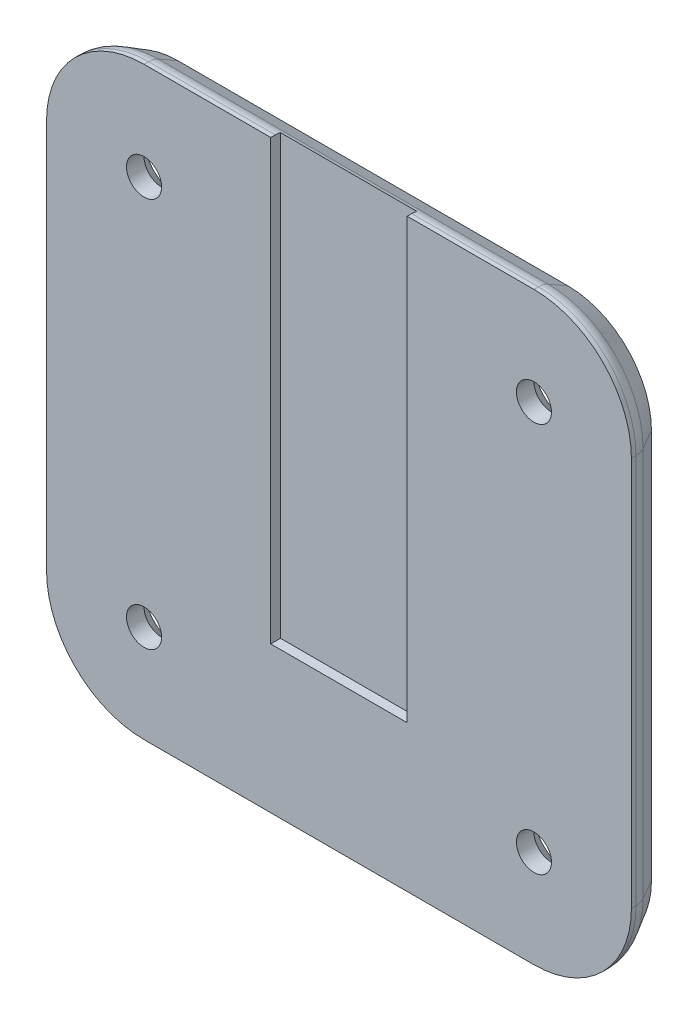
ISO-10303-21;
HEADER;
FILE_DESCRIPTION(('STEP AP214'),'2;1');
FILE_NAME('part.step','',(''),(''),'','','');
FILE_SCHEMA(('AUTOMOTIVE_DESIGN { 1 0 10303 214 1 1 1 1 }'));
ENDSEC;
DATA;
#1=APPLICATION_CONTEXT('core data for automotive mechanical design processes');
#2=APPLICATION_PROTOCOL_DEFINITION('international standard','automotive_design',2000,#1);
#3=PRODUCT_CONTEXT('',#1,'mechanical');
#4=PRODUCT('Part','Part','',(#3));
#5=PRODUCT_RELATED_PRODUCT_CATEGORY('part','',(#4));
#6=PRODUCT_DEFINITION_FORMATION('','',#4);
#7=PRODUCT_DEFINITION_CONTEXT('part definition',#1,'design');
#8=PRODUCT_DEFINITION('design','',#6,#7);
#9=PRODUCT_DEFINITION_SHAPE('','',#8);
#10=(LENGTH_UNIT() NAMED_UNIT(*) SI_UNIT(.MILLI.,.METRE.));
#11=(NAMED_UNIT(*) PLANE_ANGLE_UNIT() SI_UNIT($,.RADIAN.));
#12=(NAMED_UNIT(*) SI_UNIT($,.STERADIAN.) SOLID_ANGLE_UNIT());
#13=UNCERTAINTY_MEASURE_WITH_UNIT(LENGTH_MEASURE(1.E-05),#10,'distance_accuracy_value','');
#14=(GEOMETRIC_REPRESENTATION_CONTEXT(3) GLOBAL_UNCERTAINTY_ASSIGNED_CONTEXT((#13)) GLOBAL_UNIT_ASSIGNED_CONTEXT((#10,
#11,#12)) REPRESENTATION_CONTEXT('',''));
#15=CARTESIAN_POINT('',(0.,0.,0.));
#16=DIRECTION('',(0.,0.,1.));
#17=DIRECTION('',(1.,0.,0.));
#18=AXIS2_PLACEMENT_3D('',#15,#16,#17);
#19=CARTESIAN_POINT('',(-20.,20.,3.50000000000014));
#20=DIRECTION('',(0.,0.,1.));
#21=DIRECTION('',(1.,0.,0.));
#22=AXIS2_PLACEMENT_3D('',#19,#20,#21);
#23=PLANE('',#22);
#24=CARTESIAN_POINT('',(20.,20.,3.49999999999986));
#25=DIRECTION('',(0.,0.,-1.));
#26=DIRECTION('',(-1.,0.,0.));
#27=AXIS2_PLACEMENT_3D('',#24,#25,#26);
#28=CIRCLE('',#27,1.8);
#29=CARTESIAN_POINT('',(18.2,20.,3.49999999999987));
#30=VERTEX_POINT('',#29);
#31=EDGE_CURVE('E216',#30,#30,#28,.T.);
#32=ORIENTED_EDGE('',*,*,#31,.T.);
#33=EDGE_LOOP('',(#32));
#34=FACE_BOUND('',#33,.T.);
#35=CARTESIAN_POINT('',(-20.,20.,3.50000000000014));
#36=DIRECTION('',(0.,0.,-1.));
#37=DIRECTION('',(-1.,0.,0.));
#38=AXIS2_PLACEMENT_3D('',#35,#36,#37);
#39=CIRCLE('',#38,1.8);
#40=CARTESIAN_POINT('',(-21.8,20.,3.50000000000015));
#41=VERTEX_POINT('',#40);
#42=EDGE_CURVE('E225',#41,#41,#39,.T.);
#43=ORIENTED_EDGE('',*,*,#42,.T.);
#44=EDGE_LOOP('',(#43));
#45=FACE_BOUND('',#44,.T.);
#46=CARTESIAN_POINT('',(-20.,-20.,3.50000000000014));
#47=DIRECTION('',(0.,0.,-1.));
#48=DIRECTION('',(-1.,0.,0.));
#49=AXIS2_PLACEMENT_3D('',#46,#47,#48);
#50=CIRCLE('',#49,1.8);
#51=CARTESIAN_POINT('',(-21.8,-20.,3.50000000000015));
#52=VERTEX_POINT('',#51);
#53=EDGE_CURVE('E234',#52,#52,#50,.T.);
#54=ORIENTED_EDGE('',*,*,#53,.T.);
#55=EDGE_LOOP('',(#54));
#56=FACE_BOUND('',#55,.T.);
#57=CARTESIAN_POINT('',(20.,-20.,3.49999999999986));
#58=DIRECTION('',(0.,0.,-1.));
#59=DIRECTION('',(-1.,0.,0.));
#60=AXIS2_PLACEMENT_3D('',#57,#58,#59);
#61=CIRCLE('',#60,1.8);
#62=CARTESIAN_POINT('',(18.2,-20.,3.49999999999987));
#63=VERTEX_POINT('',#62);
#64=EDGE_CURVE('E243',#63,#63,#61,.T.);
#65=ORIENTED_EDGE('',*,*,#64,.T.);
#66=EDGE_LOOP('',(#65));
#67=FACE_BOUND('',#66,.T.);
#68=DIRECTION('',(1.,0.,0.));
#69=VECTOR('',#68,1.);
#70=CARTESIAN_POINT('',(20.,30.,3.49999999999986));
#71=LINE('',#70,#69);
#72=CARTESIAN_POINT('',(7.00000000000001,30.,3.49999999999995));
#73=VERTEX_POINT('',#72);
#74=CARTESIAN_POINT('',(20.,30.,3.49999999999986));
#75=VERTEX_POINT('',#74);
#76=EDGE_CURVE('E249',#73,#75,#71,.T.);
#77=ORIENTED_EDGE('',*,*,#76,.F.);
#78=DIRECTION('',(0.,-1.,0.));
#79=VECTOR('',#78,1.);
#80=CARTESIAN_POINT('',(7.00000000000001,20.,3.49999999999995));
#81=LINE('',#80,#79);
#82=CARTESIAN_POINT('',(7.00000000000001,-15.,3.49999999999995));
#83=VERTEX_POINT('',#82);
#84=EDGE_CURVE('E206',#73,#83,#81,.T.);
#85=ORIENTED_EDGE('',*,*,#84,.T.);
#86=DIRECTION('',(-1.,0.,0.));
#87=VECTOR('',#86,1.);
#88=CARTESIAN_POINT('',(-20.,-15.,3.50000000000014));
#89=LINE('',#88,#87);
#90=CARTESIAN_POINT('',(-6.99999999999999,-15.,3.50000000000005));
#91=VERTEX_POINT('',#90);
#92=EDGE_CURVE('E12',#83,#91,#89,.T.);
#93=ORIENTED_EDGE('',*,*,#92,.T.);
#94=DIRECTION('',(0.,1.,0.));
#95=VECTOR('',#94,1.);
#96=CARTESIAN_POINT('',(-6.99999999999999,20.,3.50000000000005));
#97=LINE('',#96,#95);
#98=CARTESIAN_POINT('',(-6.99999999999999,30.,3.50000000000005));
#99=VERTEX_POINT('',#98);
#100=EDGE_CURVE('E192',#91,#99,#97,.T.);
#101=ORIENTED_EDGE('',*,*,#100,.T.);
#102=CARTESIAN_POINT('',(-20.,30.,3.50000000000014));
#103=VERTEX_POINT('',#102);
#104=EDGE_CURVE('E250',#103,#99,#71,.T.);
#105=ORIENTED_EDGE('',*,*,#104,.F.);
#106=CARTESIAN_POINT('',(-20.,20.,3.50000000000014));
#107=DIRECTION('',(0.,0.,-1.));
#108=DIRECTION('',(1.,0.,0.));
#109=AXIS2_PLACEMENT_3D('',#106,#107,#108);
#110=CIRCLE('',#109,10.);
#111=CARTESIAN_POINT('',(-30.,20.,3.50000000000021));
#112=VERTEX_POINT('',#111);
#113=EDGE_CURVE('E246',#112,#103,#110,.T.);
#114=ORIENTED_EDGE('',*,*,#113,.F.);
#115=DIRECTION('',(0.,1.,0.));
#116=VECTOR('',#115,1.);
#117=CARTESIAN_POINT('',(-30.,20.,3.50000000000021));
#118=LINE('',#117,#116);
#119=CARTESIAN_POINT('',(-30.,-20.,3.50000000000021));
#120=VERTEX_POINT('',#119);
#121=EDGE_CURVE('E268',#120,#112,#118,.T.);
#122=ORIENTED_EDGE('',*,*,#121,.F.);
#123=CARTESIAN_POINT('',(-20.,-20.,3.50000000000014));
#124=DIRECTION('',(0.,0.,-1.));
#125=DIRECTION('',(-1.,0.,0.));
#126=AXIS2_PLACEMENT_3D('',#123,#124,#125);
#127=CIRCLE('',#126,10.);
#128=CARTESIAN_POINT('',(-20.,-30.,3.50000000000014));
#129=VERTEX_POINT('',#128);
#130=EDGE_CURVE('E265',#129,#120,#127,.T.);
#131=ORIENTED_EDGE('',*,*,#130,.F.);
#132=DIRECTION('',(-1.,0.,0.));
#133=VECTOR('',#132,1.);
#134=CARTESIAN_POINT('',(20.,-30.,3.49999999999986));
#135=LINE('',#134,#133);
#136=CARTESIAN_POINT('',(20.,-30.,3.49999999999986));
#137=VERTEX_POINT('',#136);
#138=EDGE_CURVE('E262',#137,#129,#135,.T.);
#139=ORIENTED_EDGE('',*,*,#138,.F.);
#140=CARTESIAN_POINT('',(20.,-20.,3.49999999999986));
#141=DIRECTION('',(0.,0.,-1.));
#142=DIRECTION('',(-1.,0.,0.));
#143=AXIS2_PLACEMENT_3D('',#140,#141,#142);
#144=CIRCLE('',#143,10.);
#145=CARTESIAN_POINT('',(30.,-20.,3.49999999999979));
#146=VERTEX_POINT('',#145);
#147=EDGE_CURVE('E259',#146,#137,#144,.T.);
#148=ORIENTED_EDGE('',*,*,#147,.F.);
#149=DIRECTION('',(0.,-1.,0.));
#150=VECTOR('',#149,1.);
#151=CARTESIAN_POINT('',(30.,20.,3.49999999999979));
#152=LINE('',#151,#150);
#153=CARTESIAN_POINT('',(30.,20.,3.49999999999979));
#154=VERTEX_POINT('',#153);
#155=EDGE_CURVE('E256',#154,#146,#152,.T.);
#156=ORIENTED_EDGE('',*,*,#155,.F.);
#157=CARTESIAN_POINT('',(20.,20.,3.49999999999986));
#158=DIRECTION('',(0.,0.,-1.));
#159=DIRECTION('',(-1.,0.,0.));
#160=AXIS2_PLACEMENT_3D('',#157,#158,#159);
#161=CIRCLE('',#160,10.);
#162=EDGE_CURVE('E253',#75,#154,#161,.T.);
#163=ORIENTED_EDGE('',*,*,#162,.F.);
#164=EDGE_LOOP('',(#77,#85,#93,#101,#105,#114,#122,#131,#139,#148,#156,#163));
#165=FACE_BOUND('',#164,.T.);
#166=ADVANCED_FACE('F33',(#34,#45,#56,#67,#165),#23,.T.);
#167=CARTESIAN_POINT('',(20.,30.,-1.39645239816133E-13));
#168=DIRECTION('',(0.,-1.,0.));
#169=DIRECTION('',(0.,0.,1.));
#170=AXIS2_PLACEMENT_3D('',#167,#168,#169);
#171=PLANE('',#170);
#172=DIRECTION('',(0.,0.,-1.));
#173=VECTOR('',#172,1.);
#174=CARTESIAN_POINT('',(7.00000000000003,30.,6.61581375661391));
#175=LINE('',#174,#173);
#176=CARTESIAN_POINT('',(7.00000000000001,30.,3.03589838486221));
#177=VERTEX_POINT('',#176);
#178=EDGE_CURVE('E197',#73,#177,#175,.T.);
#179=ORIENTED_EDGE('',*,*,#178,.F.);
#180=ORIENTED_EDGE('',*,*,#76,.T.);
#181=DIRECTION('',(0.,0.,1.));
#182=VECTOR('',#181,1.);
#183=CARTESIAN_POINT('',(20.,30.,-1.39645239816133E-13));
#184=LINE('',#183,#182);
#185=CARTESIAN_POINT('',(20.,30.,3.03589838486212));
#186=VERTEX_POINT('',#185);
#187=EDGE_CURVE('E283',#186,#75,#184,.T.);
#188=ORIENTED_EDGE('',*,*,#187,.F.);
#189=DIRECTION('',(1.,0.,0.));
#190=VECTOR('',#189,1.);
#191=CARTESIAN_POINT('',(-20.,30.,3.0358983848624));
#192=LINE('',#191,#190);
#193=EDGE_CURVE('E358',#186,#177,#192,.F.);
#194=ORIENTED_EDGE('',*,*,#193,.T.);
#195=EDGE_LOOP('',(#179,#180,#188,#194));
#196=FACE_BOUND('',#195,.T.);
#197=ADVANCED_FACE('F394',(#196),#171,.F.);
#198=DIRECTION('',(0.,0.,1.));
#199=VECTOR('',#198,1.);
#200=CARTESIAN_POINT('',(-6.99999999999997,30.,6.615813756614));
#201=LINE('',#200,#199);
#202=CARTESIAN_POINT('',(-6.99999999999999,30.,3.03589838486231));
#203=VERTEX_POINT('',#202);
#204=EDGE_CURVE('E201',#203,#99,#201,.T.);
#205=ORIENTED_EDGE('',*,*,#204,.F.);
#206=CARTESIAN_POINT('',(-20.,30.,3.0358983848624));
#207=VERTEX_POINT('',#206);
#208=EDGE_CURVE('E357',#203,#207,#192,.F.);
#209=ORIENTED_EDGE('',*,*,#208,.T.);
#210=DIRECTION('',(0.,0.,1.));
#211=VECTOR('',#210,1.);
#212=CARTESIAN_POINT('',(-20.,30.,1.39645239816133E-13));
#213=LINE('',#212,#211);
#214=EDGE_CURVE('E286',#207,#103,#213,.T.);
#215=ORIENTED_EDGE('',*,*,#214,.T.);
#216=ORIENTED_EDGE('',*,*,#104,.T.);
#217=EDGE_LOOP('',(#205,#209,#215,#216));
#218=FACE_BOUND('',#217,.T.);
#219=ADVANCED_FACE('F458',(#218),#171,.F.);
#220=CARTESIAN_POINT('',(20.,28.,3.03589838486212));
#221=DIRECTION('',(-1.,0.,0.));
#222=DIRECTION('',(0.,0.,1.));
#223=AXIS2_PLACEMENT_3D('',#220,#221,#222);
#224=CYLINDRICAL_SURFACE('',#223,2.);
#225=DIRECTION('',(-1.,0.,0.));
#226=VECTOR('',#225,1.);
#227=CARTESIAN_POINT('',(20.,29.9268660880046,2.49999999999986));
#228=LINE('',#227,#226);
#229=CARTESIAN_POINT('',(-6.99999999999999,29.9268660880046,2.50000000000005));
#230=VERTEX_POINT('',#229);
#231=CARTESIAN_POINT('',(7.,29.9268660880046,2.49999999999995));
#232=VERTEX_POINT('',#231);
#233=EDGE_CURVE('E386',#230,#232,#228,.F.);
#234=ORIENTED_EDGE('',*,*,#233,.T.);
#235=CARTESIAN_POINT('',(7.00000000000001,28.,3.03589838486221));
#236=DIRECTION('',(-1.,0.,0.));
#237=DIRECTION('',(0.,0.,1.));
#238=AXIS2_PLACEMENT_3D('',#235,#236,#237);
#239=CIRCLE('',#238,2.);
#240=EDGE_CURVE('E41',#232,#177,#239,.F.);
#241=ORIENTED_EDGE('',*,*,#240,.T.);
#242=ORIENTED_EDGE('',*,*,#193,.F.);
#243=CARTESIAN_POINT('',(20.,28.,3.03589838486212));
#244=DIRECTION('',(1.,0.,0.));
#245=DIRECTION('',(0.,0.,-1.));
#246=AXIS2_PLACEMENT_3D('',#243,#244,#245);
#247=CIRCLE('',#246,2.);
#248=CARTESIAN_POINT('',(20.,29.7320508075689,2.03589838486212));
#249=VERTEX_POINT('',#248);
#250=EDGE_CURVE('E208',#249,#186,#247,.T.);
#251=ORIENTED_EDGE('',*,*,#250,.F.);
#252=DIRECTION('',(-1.,0.,0.));
#253=VECTOR('',#252,1.);
#254=CARTESIAN_POINT('',(20.,29.7320508075689,2.03589838486212));
#255=LINE('',#254,#253);
#256=CARTESIAN_POINT('',(-20.,29.7320508075689,2.0358983848624));
#257=VERTEX_POINT('',#256);
#258=EDGE_CURVE('E361',#257,#249,#255,.F.);
#259=ORIENTED_EDGE('',*,*,#258,.F.);
#260=CARTESIAN_POINT('',(-20.,28.,3.0358983848624));
#261=DIRECTION('',(1.,0.,0.));
#262=DIRECTION('',(0.,0.,-1.));
#263=AXIS2_PLACEMENT_3D('',#260,#261,#262);
#264=CIRCLE('',#263,2.);
#265=EDGE_CURVE('E367',#257,#207,#264,.T.);
#266=ORIENTED_EDGE('',*,*,#265,.T.);
#267=ORIENTED_EDGE('',*,*,#208,.F.);
#268=CARTESIAN_POINT('',(-6.99999999999999,28.,3.03589838486231));
#269=DIRECTION('',(1.,0.,0.));
#270=DIRECTION('',(0.,0.,-1.));
#271=AXIS2_PLACEMENT_3D('',#268,#269,#270);
#272=CIRCLE('',#271,2.);
#273=EDGE_CURVE('E363',#203,#230,#272,.F.);
#274=ORIENTED_EDGE('',*,*,#273,.T.);
#275=EDGE_LOOP('',(#234,#241,#242,#251,#259,#266,#267,#274));
#276=FACE_BOUND('',#275,.T.);
#277=ADVANCED_FACE('F389',(#276),#224,.T.);
#278=CARTESIAN_POINT('',(-20.,20.,1.39645239816133E-13));
#279=DIRECTION('',(0.,0.,1.));
#280=DIRECTION('',(1.,0.,0.));
#281=AXIS2_PLACEMENT_3D('',#278,#279,#280);
#282=CYLINDRICAL_SURFACE('',#281,10.);
#283=ORIENTED_EDGE('',*,*,#214,.F.);
#284=CARTESIAN_POINT('',(-20.,20.,3.0358983848624));
#285=DIRECTION('',(0.,0.,-1.));
#286=DIRECTION('',(-1.,0.,0.));
#287=AXIS2_PLACEMENT_3D('',#284,#285,#286);
#288=CIRCLE('',#287,10.);
#289=CARTESIAN_POINT('',(-30.,20.,3.03589838486247));
#290=VERTEX_POINT('',#289);
#291=EDGE_CURVE('E354',#207,#290,#288,.F.);
#292=ORIENTED_EDGE('',*,*,#291,.T.);
#293=DIRECTION('',(0.,0.,1.));
#294=VECTOR('',#293,1.);
#295=CARTESIAN_POINT('',(-30.,20.,2.09467859724199E-13));
#296=LINE('',#295,#294);
#297=EDGE_CURVE('E271',#290,#112,#296,.T.);
#298=ORIENTED_EDGE('',*,*,#297,.T.);
#299=ORIENTED_EDGE('',*,*,#113,.T.);
#300=EDGE_LOOP('',(#283,#292,#298,#299));
#301=FACE_BOUND('',#300,.T.);
#302=ADVANCED_FACE('F448',(#301),#282,.T.);
#303=CARTESIAN_POINT('',(20.,20.,-1.39645239816133E-13));
#304=DIRECTION('',(0.,0.,1.));
#305=DIRECTION('',(1.,0.,0.));
#306=AXIS2_PLACEMENT_3D('',#303,#304,#305);
#307=CYLINDRICAL_SURFACE('',#306,10.);
#308=DIRECTION('',(0.,0.,1.));
#309=VECTOR('',#308,1.);
#310=CARTESIAN_POINT('',(30.,20.,-2.09467859724199E-13));
#311=LINE('',#310,#309);
#312=CARTESIAN_POINT('',(30.,20.,3.03589838486205));
#313=VERTEX_POINT('',#312);
#314=EDGE_CURVE('E281',#313,#154,#311,.T.);
#315=ORIENTED_EDGE('',*,*,#314,.F.);
#316=CARTESIAN_POINT('',(20.,20.,3.03589838486212));
#317=DIRECTION('',(0.,0.,-1.));
#318=DIRECTION('',(-1.,0.,0.));
#319=AXIS2_PLACEMENT_3D('',#316,#317,#318);
#320=CIRCLE('',#319,10.);
#321=EDGE_CURVE('E308',#313,#186,#320,.F.);
#322=ORIENTED_EDGE('',*,*,#321,.T.);
#323=ORIENTED_EDGE('',*,*,#187,.T.);
#324=ORIENTED_EDGE('',*,*,#162,.T.);
#325=EDGE_LOOP('',(#315,#322,#323,#324));
#326=FACE_BOUND('',#325,.T.);
#327=ADVANCED_FACE('F399',(#326),#307,.T.);
#328=CARTESIAN_POINT('',(30.,20.,-2.09467859724199E-13));
#329=DIRECTION('',(-1.,0.,0.));
#330=DIRECTION('',(0.,0.,1.));
#331=AXIS2_PLACEMENT_3D('',#328,#329,#330);
#332=PLANE('',#331);
#333=DIRECTION('',(0.,0.,1.));
#334=VECTOR('',#333,1.);
#335=CARTESIAN_POINT('',(30.,-20.,-2.09467859724199E-13));
#336=LINE('',#335,#334);
#337=CARTESIAN_POINT('',(30.,-20.,3.03589838486204));
#338=VERTEX_POINT('',#337);
#339=EDGE_CURVE('E279',#338,#146,#336,.T.);
#340=ORIENTED_EDGE('',*,*,#339,.F.);
#341=DIRECTION('',(0.,-1.,0.));
#342=VECTOR('',#341,1.);
#343=CARTESIAN_POINT('',(30.,20.,3.03589838486205));
#344=LINE('',#343,#342);
#345=EDGE_CURVE('E334',#338,#313,#344,.F.);
#346=ORIENTED_EDGE('',*,*,#345,.T.);
#347=ORIENTED_EDGE('',*,*,#314,.T.);
#348=ORIENTED_EDGE('',*,*,#155,.T.);
#349=EDGE_LOOP('',(#340,#346,#347,#348));
#350=FACE_BOUND('',#349,.T.);
#351=ADVANCED_FACE('F407',(#350),#332,.F.);
#352=CARTESIAN_POINT('',(20.,-20.,-1.39645239816133E-13));
#353=DIRECTION('',(0.,0.,1.));
#354=DIRECTION('',(1.,0.,0.));
#355=AXIS2_PLACEMENT_3D('',#352,#353,#354);
#356=CYLINDRICAL_SURFACE('',#355,10.);
#357=DIRECTION('',(0.,0.,1.));
#358=VECTOR('',#357,1.);
#359=CARTESIAN_POINT('',(20.,-30.,-1.39645239816133E-13));
#360=LINE('',#359,#358);
#361=CARTESIAN_POINT('',(20.,-30.,3.03589838486212));
#362=VERTEX_POINT('',#361);
#363=EDGE_CURVE('E277',#362,#137,#360,.T.);
#364=ORIENTED_EDGE('',*,*,#363,.F.);
#365=CARTESIAN_POINT('',(20.,-20.,3.03589838486211));
#366=DIRECTION('',(0.,0.,-1.));
#367=DIRECTION('',(-1.,0.,0.));
#368=AXIS2_PLACEMENT_3D('',#365,#366,#367);
#369=CIRCLE('',#368,10.);
#370=EDGE_CURVE('E338',#362,#338,#369,.F.);
#371=ORIENTED_EDGE('',*,*,#370,.T.);
#372=ORIENTED_EDGE('',*,*,#339,.T.);
#373=ORIENTED_EDGE('',*,*,#147,.T.);
#374=EDGE_LOOP('',(#364,#371,#372,#373));
#375=FACE_BOUND('',#374,.T.);
#376=ADVANCED_FACE('F488',(#375),#356,.T.);
#377=CARTESIAN_POINT('',(20.,-30.,-1.39645239816133E-13));
#378=DIRECTION('',(0.,1.,0.));
#379=DIRECTION('',(0.,0.,-1.));
#380=AXIS2_PLACEMENT_3D('',#377,#378,#379);
#381=PLANE('',#380);
#382=DIRECTION('',(0.,0.,1.));
#383=VECTOR('',#382,1.);
#384=CARTESIAN_POINT('',(-20.,-30.,1.39645239816133E-13));
#385=LINE('',#384,#383);
#386=CARTESIAN_POINT('',(-20.,-30.,3.0358983848624));
#387=VERTEX_POINT('',#386);
#388=EDGE_CURVE('E275',#387,#129,#385,.T.);
#389=ORIENTED_EDGE('',*,*,#388,.F.);
#390=DIRECTION('',(-1.,0.,0.));
#391=VECTOR('',#390,1.);
#392=CARTESIAN_POINT('',(20.,-30.,3.03589838486212));
#393=LINE('',#392,#391);
#394=EDGE_CURVE('E342',#387,#362,#393,.F.);
#395=ORIENTED_EDGE('',*,*,#394,.T.);
#396=ORIENTED_EDGE('',*,*,#363,.T.);
#397=ORIENTED_EDGE('',*,*,#138,.T.);
#398=EDGE_LOOP('',(#389,#395,#396,#397));
#399=FACE_BOUND('',#398,.T.);
#400=ADVANCED_FACE('F484',(#399),#381,.F.);
#401=CARTESIAN_POINT('',(-20.,-20.,1.39645239816133E-13));
#402=DIRECTION('',(0.,0.,1.));
#403=DIRECTION('',(1.,0.,0.));
#404=AXIS2_PLACEMENT_3D('',#401,#402,#403);
#405=CYLINDRICAL_SURFACE('',#404,10.);
#406=DIRECTION('',(0.,0.,1.));
#407=VECTOR('',#406,1.);
#408=CARTESIAN_POINT('',(-30.,-20.,2.09467859724199E-13));
#409=LINE('',#408,#407);
#410=CARTESIAN_POINT('',(-30.,-20.,3.03589838486247));
#411=VERTEX_POINT('',#410);
#412=EDGE_CURVE('E273',#411,#120,#409,.T.);
#413=ORIENTED_EDGE('',*,*,#412,.F.);
#414=CARTESIAN_POINT('',(-20.,-20.,3.0358983848624));
#415=DIRECTION('',(0.,0.,-1.));
#416=DIRECTION('',(-1.,0.,0.));
#417=AXIS2_PLACEMENT_3D('',#414,#415,#416);
#418=CIRCLE('',#417,10.);
#419=EDGE_CURVE('E346',#411,#387,#418,.F.);
#420=ORIENTED_EDGE('',*,*,#419,.T.);
#421=ORIENTED_EDGE('',*,*,#388,.T.);
#422=ORIENTED_EDGE('',*,*,#130,.T.);
#423=EDGE_LOOP('',(#413,#420,#421,#422));
#424=FACE_BOUND('',#423,.T.);
#425=ADVANCED_FACE('F481',(#424),#405,.T.);
#426=CARTESIAN_POINT('',(-30.,20.,2.09467859724199E-13));
#427=DIRECTION('',(1.,0.,0.));
#428=DIRECTION('',(0.,0.,-1.));
#429=AXIS2_PLACEMENT_3D('',#426,#427,#428);
#430=PLANE('',#429);
#431=ORIENTED_EDGE('',*,*,#297,.F.);
#432=DIRECTION('',(0.,1.,0.));
#433=VECTOR('',#432,1.);
#434=CARTESIAN_POINT('',(-30.,-20.,3.03589838486247));
#435=LINE('',#434,#433);
#436=EDGE_CURVE('E350',#290,#411,#435,.F.);
#437=ORIENTED_EDGE('',*,*,#436,.T.);
#438=ORIENTED_EDGE('',*,*,#412,.T.);
#439=ORIENTED_EDGE('',*,*,#121,.T.);
#440=EDGE_LOOP('',(#431,#437,#438,#439));
#441=FACE_BOUND('',#440,.T.);
#442=ADVANCED_FACE('F450',(#441),#430,.F.);
#443=CARTESIAN_POINT('',(-20.,20.,1.39645239816133E-13));
#444=DIRECTION('',(0.,0.,1.));
#445=DIRECTION('',(1.,0.,0.));
#446=AXIS2_PLACEMENT_3D('',#443,#444,#445);
#447=PLANE('',#446);
#448=CARTESIAN_POINT('',(20.,-20.,-1.39645239816133E-13));
#449=DIRECTION('',(0.,0.,1.));
#450=DIRECTION('',(1.,0.,0.));
#451=AXIS2_PLACEMENT_3D('',#448,#449,#450);
#452=CIRCLE('',#451,8.55662432702594);
#453=CARTESIAN_POINT('',(28.5566243270259,-20.,-1.99493199737333E-13));
#454=VERTEX_POINT('',#453);
#455=CARTESIAN_POINT('',(20.,-28.5566243270259,-1.39645239816133E-13));
#456=VERTEX_POINT('',#455);
#457=EDGE_CURVE('E300',#454,#456,#452,.F.);
#458=ORIENTED_EDGE('',*,*,#457,.T.);
#459=DIRECTION('',(-1.,0.,0.));
#460=VECTOR('',#459,1.);
#461=CARTESIAN_POINT('',(-20.,-28.5566243270259,1.39645239816133E-13));
#462=LINE('',#461,#460);
#463=CARTESIAN_POINT('',(-20.,-28.5566243270259,1.39645239816133E-13));
#464=VERTEX_POINT('',#463);
#465=EDGE_CURVE('E305',#456,#464,#462,.T.);
#466=ORIENTED_EDGE('',*,*,#465,.T.);
#467=CARTESIAN_POINT('',(-20.,-20.,1.39645239816133E-13));
#468=DIRECTION('',(0.,0.,1.));
#469=DIRECTION('',(1.,0.,0.));
#470=AXIS2_PLACEMENT_3D('',#467,#468,#469);
#471=CIRCLE('',#470,8.55662432702594);
#472=CARTESIAN_POINT('',(-28.5566243270259,-20.,1.99493199737333E-13));
#473=VERTEX_POINT('',#472);
#474=EDGE_CURVE('E302',#464,#473,#471,.F.);
#475=ORIENTED_EDGE('',*,*,#474,.T.);
#476=DIRECTION('',(0.,1.,0.));
#477=VECTOR('',#476,1.);
#478=CARTESIAN_POINT('',(-28.5566243270259,20.,1.99493199737333E-13));
#479=LINE('',#478,#477);
#480=CARTESIAN_POINT('',(-28.556624327026,20.,1.99493199737333E-13));
#481=VERTEX_POINT('',#480);
#482=EDGE_CURVE('E297',#473,#481,#479,.T.);
#483=ORIENTED_EDGE('',*,*,#482,.T.);
#484=CARTESIAN_POINT('',(-20.,20.,1.39645239816133E-13));
#485=DIRECTION('',(0.,0.,1.));
#486=DIRECTION('',(1.,0.,0.));
#487=AXIS2_PLACEMENT_3D('',#484,#485,#486);
#488=CIRCLE('',#487,8.55662432702594);
#489=CARTESIAN_POINT('',(-20.,28.5566243270259,1.39645239816133E-13));
#490=VERTEX_POINT('',#489);
#491=EDGE_CURVE('E292',#481,#490,#488,.F.);
#492=ORIENTED_EDGE('',*,*,#491,.T.);
#493=DIRECTION('',(1.,0.,0.));
#494=VECTOR('',#493,1.);
#495=CARTESIAN_POINT('',(-20.,28.5566243270259,1.39645239816133E-13));
#496=LINE('',#495,#494);
#497=CARTESIAN_POINT('',(20.,28.5566243270259,-1.39645239816133E-13));
#498=VERTEX_POINT('',#497);
#499=EDGE_CURVE('E288',#490,#498,#496,.T.);
#500=ORIENTED_EDGE('',*,*,#499,.T.);
#501=CARTESIAN_POINT('',(20.,20.,-1.39645239816133E-13));
#502=DIRECTION('',(0.,0.,1.));
#503=DIRECTION('',(1.,0.,0.));
#504=AXIS2_PLACEMENT_3D('',#501,#502,#503);
#505=CIRCLE('',#504,8.55662432702594);
#506=CARTESIAN_POINT('',(28.5566243270259,20.,-1.99493199737333E-13));
#507=VERTEX_POINT('',#506);
#508=EDGE_CURVE('E290',#498,#507,#505,.F.);
#509=ORIENTED_EDGE('',*,*,#508,.T.);
#510=DIRECTION('',(0.,-1.,0.));
#511=VECTOR('',#510,1.);
#512=CARTESIAN_POINT('',(28.5566243270259,20.,-1.99493199737333E-13));
#513=LINE('',#512,#511);
#514=EDGE_CURVE('E295',#507,#454,#513,.T.);
#515=ORIENTED_EDGE('',*,*,#514,.T.);
#516=EDGE_LOOP('',(#458,#466,#475,#483,#492,#500,#509,#515));
#517=FACE_BOUND('',#516,.T.);
#518=CARTESIAN_POINT('',(20.,20.,-1.39645239816133E-13));
#519=DIRECTION('',(0.,0.,-1.));
#520=DIRECTION('',(-1.,0.,0.));
#521=AXIS2_PLACEMENT_3D('',#518,#519,#520);
#522=CIRCLE('',#521,3.5);
#523=CARTESIAN_POINT('',(16.5,20.,-1.15204870444231E-13));
#524=VERTEX_POINT('',#523);
#525=EDGE_CURVE('E209',#524,#524,#522,.T.);
#526=ORIENTED_EDGE('',*,*,#525,.F.);
#527=EDGE_LOOP('',(#526));
#528=FACE_BOUND('',#527,.T.);
#529=CARTESIAN_POINT('',(-20.,20.,1.39645239816133E-13));
#530=DIRECTION('',(0.,0.,-1.));
#531=DIRECTION('',(-1.,0.,0.));
#532=AXIS2_PLACEMENT_3D('',#529,#530,#531);
#533=CIRCLE('',#532,3.5);
#534=CARTESIAN_POINT('',(-23.5,20.,1.64085609188035E-13));
#535=VERTEX_POINT('',#534);
#536=EDGE_CURVE('E219',#535,#535,#533,.T.);
#537=ORIENTED_EDGE('',*,*,#536,.F.);
#538=EDGE_LOOP('',(#537));
#539=FACE_BOUND('',#538,.T.);
#540=CARTESIAN_POINT('',(-20.,-20.,1.39645239816133E-13));
#541=DIRECTION('',(0.,0.,-1.));
#542=DIRECTION('',(-1.,0.,0.));
#543=AXIS2_PLACEMENT_3D('',#540,#541,#542);
#544=CIRCLE('',#543,3.5);
#545=CARTESIAN_POINT('',(-23.5,-20.,1.64085609188035E-13));
#546=VERTEX_POINT('',#545);
#547=EDGE_CURVE('E228',#546,#546,#544,.T.);
#548=ORIENTED_EDGE('',*,*,#547,.F.);
#549=EDGE_LOOP('',(#548));
#550=FACE_BOUND('',#549,.T.);
#551=CARTESIAN_POINT('',(20.,-20.,-1.39645239816133E-13));
#552=DIRECTION('',(0.,0.,-1.));
#553=DIRECTION('',(-1.,0.,0.));
#554=AXIS2_PLACEMENT_3D('',#551,#552,#553);
#555=CIRCLE('',#554,3.5);
#556=CARTESIAN_POINT('',(16.5,-20.,-1.15204870444231E-13));
#557=VERTEX_POINT('',#556);
#558=EDGE_CURVE('E237',#557,#557,#555,.T.);
#559=ORIENTED_EDGE('',*,*,#558,.F.);
#560=EDGE_LOOP('',(#559));
#561=FACE_BOUND('',#560,.T.);
#562=ADVANCED_FACE('F430',(#517,#528,#539,#550,#561),#447,.F.);
#563=CARTESIAN_POINT('',(20.,-20.,-1.39645239816133E-13));
#564=DIRECTION('',(0.,0.,-1.));
#565=DIRECTION('',(-1.,0.,0.));
#566=AXIS2_PLACEMENT_3D('',#563,#564,#565);
#567=CYLINDRICAL_SURFACE('',#566,1.8);
#568=ORIENTED_EDGE('',*,*,#64,.F.);
#569=EDGE_LOOP('',(#568));
#570=FACE_BOUND('',#569,.T.);
#571=CARTESIAN_POINT('',(20.,-20.,1.69999999999986));
#572=DIRECTION('',(0.,0.,-1.));
#573=DIRECTION('',(-1.,0.,0.));
#574=AXIS2_PLACEMENT_3D('',#571,#572,#573);
#575=CIRCLE('',#574,1.8);
#576=CARTESIAN_POINT('',(18.2,-20.,1.69999999999987));
#577=VERTEX_POINT('',#576);
#578=EDGE_CURVE('E240',#577,#577,#575,.T.);
#579=ORIENTED_EDGE('',*,*,#578,.T.);
#580=EDGE_LOOP('',(#579));
#581=FACE_BOUND('',#580,.T.);
#582=ADVANCED_FACE('F667',(#570,#581),#567,.F.);
#583=CARTESIAN_POINT('',(20.,-20.,-1.39645239816133E-13));
#584=DIRECTION('',(0.,0.,-1.));
#585=DIRECTION('',(-1.,0.,0.));
#586=AXIS2_PLACEMENT_3D('',#583,#584,#585);
#587=CONICAL_SURFACE('',#586,3.5,0.785398163397448);
#588=ORIENTED_EDGE('',*,*,#578,.F.);
#589=EDGE_LOOP('',(#588));
#590=FACE_BOUND('',#589,.T.);
#591=ORIENTED_EDGE('',*,*,#558,.T.);
#592=EDGE_LOOP('',(#591));
#593=FACE_BOUND('',#592,.T.);
#594=ADVANCED_FACE('F658',(#590,#593),#587,.F.);
#595=CARTESIAN_POINT('',(-20.,-20.,1.39645239816133E-13));
#596=DIRECTION('',(0.,0.,-1.));
#597=DIRECTION('',(-1.,0.,0.));
#598=AXIS2_PLACEMENT_3D('',#595,#596,#597);
#599=CYLINDRICAL_SURFACE('',#598,1.8);
#600=ORIENTED_EDGE('',*,*,#53,.F.);
#601=EDGE_LOOP('',(#600));
#602=FACE_BOUND('',#601,.T.);
#603=CARTESIAN_POINT('',(-20.,-20.,1.70000000000014));
#604=DIRECTION('',(0.,0.,-1.));
#605=DIRECTION('',(-1.,0.,0.));
#606=AXIS2_PLACEMENT_3D('',#603,#604,#605);
#607=CIRCLE('',#606,1.8);
#608=CARTESIAN_POINT('',(-21.8,-20.,1.70000000000015));
#609=VERTEX_POINT('',#608);
#610=EDGE_CURVE('E231',#609,#609,#607,.T.);
#611=ORIENTED_EDGE('',*,*,#610,.T.);
#612=EDGE_LOOP('',(#611));
#613=FACE_BOUND('',#612,.T.);
#614=ADVANCED_FACE('F649',(#602,#613),#599,.F.);
#615=CARTESIAN_POINT('',(-20.,-20.,1.39645239816133E-13));
#616=DIRECTION('',(0.,0.,-1.));
#617=DIRECTION('',(-1.,0.,0.));
#618=AXIS2_PLACEMENT_3D('',#615,#616,#617);
#619=CONICAL_SURFACE('',#618,3.5,0.785398163397448);
#620=ORIENTED_EDGE('',*,*,#610,.F.);
#621=EDGE_LOOP('',(#620));
#622=FACE_BOUND('',#621,.T.);
#623=ORIENTED_EDGE('',*,*,#547,.T.);
#624=EDGE_LOOP('',(#623));
#625=FACE_BOUND('',#624,.T.);
#626=ADVANCED_FACE('F640',(#622,#625),#619,.F.);
#627=CARTESIAN_POINT('',(-20.,20.,1.39645239816133E-13));
#628=DIRECTION('',(0.,0.,-1.));
#629=DIRECTION('',(-1.,0.,0.));
#630=AXIS2_PLACEMENT_3D('',#627,#628,#629);
#631=CYLINDRICAL_SURFACE('',#630,1.8);
#632=ORIENTED_EDGE('',*,*,#42,.F.);
#633=EDGE_LOOP('',(#632));
#634=FACE_BOUND('',#633,.T.);
#635=CARTESIAN_POINT('',(-20.,20.,1.70000000000014));
#636=DIRECTION('',(0.,0.,-1.));
#637=DIRECTION('',(-1.,0.,0.));
#638=AXIS2_PLACEMENT_3D('',#635,#636,#637);
#639=CIRCLE('',#638,1.8);
#640=CARTESIAN_POINT('',(-21.8,20.,1.70000000000015));
#641=VERTEX_POINT('',#640);
#642=EDGE_CURVE('E222',#641,#641,#639,.T.);
#643=ORIENTED_EDGE('',*,*,#642,.T.);
#644=EDGE_LOOP('',(#643));
#645=FACE_BOUND('',#644,.T.);
#646=ADVANCED_FACE('F631',(#634,#645),#631,.F.);
#647=CARTESIAN_POINT('',(-20.,20.,1.39645239816133E-13));
#648=DIRECTION('',(0.,0.,-1.));
#649=DIRECTION('',(-1.,0.,0.));
#650=AXIS2_PLACEMENT_3D('',#647,#648,#649);
#651=CONICAL_SURFACE('',#650,3.5,0.785398163397448);
#652=ORIENTED_EDGE('',*,*,#642,.F.);
#653=EDGE_LOOP('',(#652));
#654=FACE_BOUND('',#653,.T.);
#655=ORIENTED_EDGE('',*,*,#536,.T.);
#656=EDGE_LOOP('',(#655));
#657=FACE_BOUND('',#656,.T.);
#658=ADVANCED_FACE('F622',(#654,#657),#651,.F.);
#659=CARTESIAN_POINT('',(20.,20.,-1.39645239816133E-13));
#660=DIRECTION('',(0.,0.,-1.));
#661=DIRECTION('',(-1.,0.,0.));
#662=AXIS2_PLACEMENT_3D('',#659,#660,#661);
#663=CYLINDRICAL_SURFACE('',#662,1.8);
#664=ORIENTED_EDGE('',*,*,#31,.F.);
#665=EDGE_LOOP('',(#664));
#666=FACE_BOUND('',#665,.T.);
#667=CARTESIAN_POINT('',(20.,20.,1.69999999999986));
#668=DIRECTION('',(0.,0.,-1.));
#669=DIRECTION('',(-1.,0.,0.));
#670=AXIS2_PLACEMENT_3D('',#667,#668,#669);
#671=CIRCLE('',#670,1.8);
#672=CARTESIAN_POINT('',(18.2,20.,1.69999999999987));
#673=VERTEX_POINT('',#672);
#674=EDGE_CURVE('E212',#673,#673,#671,.T.);
#675=ORIENTED_EDGE('',*,*,#674,.T.);
#676=EDGE_LOOP('',(#675));
#677=FACE_BOUND('',#676,.T.);
#678=ADVANCED_FACE('F613',(#666,#677),#663,.F.);
#679=CARTESIAN_POINT('',(20.,20.,-1.39645239816133E-13));
#680=DIRECTION('',(0.,0.,-1.));
#681=DIRECTION('',(-1.,0.,0.));
#682=AXIS2_PLACEMENT_3D('',#679,#680,#681);
#683=CONICAL_SURFACE('',#682,3.5,0.785398163397448);
#684=ORIENTED_EDGE('',*,*,#674,.F.);
#685=EDGE_LOOP('',(#684));
#686=FACE_BOUND('',#685,.T.);
#687=ORIENTED_EDGE('',*,*,#525,.T.);
#688=EDGE_LOOP('',(#687));
#689=FACE_BOUND('',#688,.T.);
#690=ADVANCED_FACE('F524',(#686,#689),#683,.F.);
#691=CARTESIAN_POINT('',(-20.,28.5566243270259,1.39645239816133E-13));
#692=DIRECTION('',(0.,-0.86602540378444,0.499999999999997));
#693=DIRECTION('',(1.,0.,0.));
#694=AXIS2_PLACEMENT_3D('',#691,#692,#693);
#695=PLANE('',#694);
#696=DIRECTION('',(0.,-0.499999999999997,-0.86602540378444));
#697=VECTOR('',#696,1.);
#698=CARTESIAN_POINT('',(-20.,30.,2.50000000000016));
#699=LINE('',#698,#697);
#700=EDGE_CURVE('E325',#257,#490,#699,.T.);
#701=ORIENTED_EDGE('',*,*,#700,.F.);
#702=ORIENTED_EDGE('',*,*,#258,.T.);
#703=DIRECTION('',(0.,0.499999999999997,0.86602540378444));
#704=VECTOR('',#703,1.);
#705=CARTESIAN_POINT('',(20.,28.5566243270259,-1.39645239816133E-13));
#706=LINE('',#705,#704);
#707=EDGE_CURVE('E213',#498,#249,#706,.T.);
#708=ORIENTED_EDGE('',*,*,#707,.F.);
#709=ORIENTED_EDGE('',*,*,#499,.F.);
#710=EDGE_LOOP('',(#701,#702,#708,#709));
#711=FACE_BOUND('',#710,.T.);
#712=ADVANCED_FACE('F422',(#711),#695,.F.);
#713=CARTESIAN_POINT('',(20.,20.,-1.39645239816133E-13));
#714=DIRECTION('',(0.,0.,1.));
#715=DIRECTION('',(1.,0.,0.));
#716=AXIS2_PLACEMENT_3D('',#713,#714,#715);
#717=CONICAL_SURFACE('',#716,8.55662432702594,0.523598775598295);
#718=ORIENTED_EDGE('',*,*,#707,.T.);
#719=CARTESIAN_POINT('',(20.,20.,2.03589838486212));
#720=DIRECTION('',(0.,0.,1.));
#721=DIRECTION('',(1.,0.,0.));
#722=AXIS2_PLACEMENT_3D('',#719,#720,#721);
#723=CIRCLE('',#722,9.73205080756888);
#724=CARTESIAN_POINT('',(29.7320508075689,20.,2.03589838486205));
#725=VERTEX_POINT('',#724);
#726=EDGE_CURVE('E331',#249,#725,#723,.F.);
#727=ORIENTED_EDGE('',*,*,#726,.T.);
#728=DIRECTION('',(0.500000000000003,0.,0.866025403784437));
#729=VECTOR('',#728,1.);
#730=CARTESIAN_POINT('',(28.5566243270259,20.,-1.99493199737333E-13));
#731=LINE('',#730,#729);
#732=EDGE_CURVE('E322',#507,#725,#731,.T.);
#733=ORIENTED_EDGE('',*,*,#732,.F.);
#734=ORIENTED_EDGE('',*,*,#508,.F.);
#735=EDGE_LOOP('',(#718,#727,#733,#734));
#736=FACE_BOUND('',#735,.T.);
#737=ADVANCED_FACE('F426',(#736),#717,.T.);
#738=CARTESIAN_POINT('',(-20.,20.,1.39645239816133E-13));
#739=DIRECTION('',(0.,0.,1.));
#740=DIRECTION('',(1.,0.,0.));
#741=AXIS2_PLACEMENT_3D('',#738,#739,#740);
#742=CONICAL_SURFACE('',#741,8.55662432702594,0.523598775598295);
#743=DIRECTION('',(0.499999999999991,0.,-0.866025403784444));
#744=VECTOR('',#743,1.);
#745=CARTESIAN_POINT('',(-30.,20.,2.50000000000023));
#746=LINE('',#745,#744);
#747=CARTESIAN_POINT('',(-29.7320508075689,20.,2.03589838486247));
#748=VERTEX_POINT('',#747);
#749=EDGE_CURVE('E320',#748,#481,#746,.T.);
#750=ORIENTED_EDGE('',*,*,#749,.F.);
#751=CARTESIAN_POINT('',(-20.,20.,2.0358983848624));
#752=DIRECTION('',(0.,0.,1.));
#753=DIRECTION('',(1.,0.,0.));
#754=AXIS2_PLACEMENT_3D('',#751,#752,#753);
#755=CIRCLE('',#754,9.73205080756888);
#756=EDGE_CURVE('E56',#748,#257,#755,.F.);
#757=ORIENTED_EDGE('',*,*,#756,.T.);
#758=ORIENTED_EDGE('',*,*,#700,.T.);
#759=ORIENTED_EDGE('',*,*,#491,.F.);
#760=EDGE_LOOP('',(#750,#757,#758,#759));
#761=FACE_BOUND('',#760,.T.);
#762=ADVANCED_FACE('F435',(#761),#742,.T.);
#763=CARTESIAN_POINT('',(28.5566243270259,20.,-1.99493199737333E-13));
#764=DIRECTION('',(-0.866025403784437,0.,0.500000000000003));
#765=DIRECTION('',(0.,-1.,0.));
#766=AXIS2_PLACEMENT_3D('',#763,#764,#765);
#767=PLANE('',#766);
#768=ORIENTED_EDGE('',*,*,#732,.T.);
#769=DIRECTION('',(0.,1.,0.));
#770=VECTOR('',#769,1.);
#771=CARTESIAN_POINT('',(29.7320508075689,-20.,2.03589838486206));
#772=LINE('',#771,#770);
#773=CARTESIAN_POINT('',(29.7320508075689,-20.,2.03589838486205));
#774=VERTEX_POINT('',#773);
#775=EDGE_CURVE('E336',#725,#774,#772,.F.);
#776=ORIENTED_EDGE('',*,*,#775,.T.);
#777=DIRECTION('',(0.500000000000003,0.,0.866025403784437));
#778=VECTOR('',#777,1.);
#779=CARTESIAN_POINT('',(28.5566243270259,-20.,-1.99493199737333E-13));
#780=LINE('',#779,#778);
#781=EDGE_CURVE('E317',#454,#774,#780,.T.);
#782=ORIENTED_EDGE('',*,*,#781,.F.);
#783=ORIENTED_EDGE('',*,*,#514,.F.);
#784=EDGE_LOOP('',(#768,#776,#782,#783));
#785=FACE_BOUND('',#784,.T.);
#786=ADVANCED_FACE('F514',(#785),#767,.F.);
#787=CARTESIAN_POINT('',(-28.5566243270259,20.,1.99493199737333E-13));
#788=DIRECTION('',(0.866025403784444,0.,0.499999999999991));
#789=DIRECTION('',(0.,1.,0.));
#790=AXIS2_PLACEMENT_3D('',#787,#788,#789);
#791=PLANE('',#790);
#792=DIRECTION('',(0.499999999999991,0.,-0.866025403784444));
#793=VECTOR('',#792,1.);
#794=CARTESIAN_POINT('',(-30.,-20.,2.50000000000023));
#795=LINE('',#794,#793);
#796=CARTESIAN_POINT('',(-29.7320508075689,-20.,2.03589838486247));
#797=VERTEX_POINT('',#796);
#798=EDGE_CURVE('E315',#797,#473,#795,.T.);
#799=ORIENTED_EDGE('',*,*,#798,.F.);
#800=DIRECTION('',(0.,-1.,0.));
#801=VECTOR('',#800,1.);
#802=CARTESIAN_POINT('',(-29.7320508075689,20.,2.03589838486247));
#803=LINE('',#802,#801);
#804=EDGE_CURVE('E352',#797,#748,#803,.F.);
#805=ORIENTED_EDGE('',*,*,#804,.T.);
#806=ORIENTED_EDGE('',*,*,#749,.T.);
#807=ORIENTED_EDGE('',*,*,#482,.F.);
#808=EDGE_LOOP('',(#799,#805,#806,#807));
#809=FACE_BOUND('',#808,.T.);
#810=ADVANCED_FACE('F510',(#809),#791,.F.);
#811=CARTESIAN_POINT('',(20.,-20.,-1.39645239816133E-13));
#812=DIRECTION('',(0.,0.,1.));
#813=DIRECTION('',(1.,0.,0.));
#814=AXIS2_PLACEMENT_3D('',#811,#812,#813);
#815=CONICAL_SURFACE('',#814,8.55662432702594,0.523598775598295);
#816=ORIENTED_EDGE('',*,*,#781,.T.);
#817=CARTESIAN_POINT('',(20.,-20.,2.03589838486212));
#818=DIRECTION('',(0.,0.,1.));
#819=DIRECTION('',(1.,0.,0.));
#820=AXIS2_PLACEMENT_3D('',#817,#818,#819);
#821=CIRCLE('',#820,9.73205080756888);
#822=CARTESIAN_POINT('',(20.,-29.7320508075689,2.03589838486213));
#823=VERTEX_POINT('',#822);
#824=EDGE_CURVE('E340',#774,#823,#821,.F.);
#825=ORIENTED_EDGE('',*,*,#824,.T.);
#826=DIRECTION('',(0.,-0.499999999999997,0.86602540378444));
#827=VECTOR('',#826,1.);
#828=CARTESIAN_POINT('',(20.,-28.5566243270259,-1.39645239816133E-13));
#829=LINE('',#828,#827);
#830=EDGE_CURVE('E311',#456,#823,#829,.T.);
#831=ORIENTED_EDGE('',*,*,#830,.F.);
#832=ORIENTED_EDGE('',*,*,#457,.F.);
#833=EDGE_LOOP('',(#816,#825,#831,#832));
#834=FACE_BOUND('',#833,.T.);
#835=ADVANCED_FACE('F506',(#834),#815,.T.);
#836=CARTESIAN_POINT('',(-20.,-20.,1.39645239816133E-13));
#837=DIRECTION('',(0.,0.,1.));
#838=DIRECTION('',(1.,0.,0.));
#839=AXIS2_PLACEMENT_3D('',#836,#837,#838);
#840=CONICAL_SURFACE('',#839,8.55662432702594,0.523598775598295);
#841=DIRECTION('',(0.,0.499999999999997,-0.86602540378444));
#842=VECTOR('',#841,1.);
#843=CARTESIAN_POINT('',(-20.,-30.,2.50000000000016));
#844=LINE('',#843,#842);
#845=CARTESIAN_POINT('',(-20.,-29.7320508075689,2.0358983848624));
#846=VERTEX_POINT('',#845);
#847=EDGE_CURVE('E309',#846,#464,#844,.T.);
#848=ORIENTED_EDGE('',*,*,#847,.F.);
#849=CARTESIAN_POINT('',(-20.,-20.,2.03589838486241));
#850=DIRECTION('',(0.,0.,1.));
#851=DIRECTION('',(1.,0.,0.));
#852=AXIS2_PLACEMENT_3D('',#849,#850,#851);
#853=CIRCLE('',#852,9.73205080756888);
#854=EDGE_CURVE('E348',#846,#797,#853,.F.);
#855=ORIENTED_EDGE('',*,*,#854,.T.);
#856=ORIENTED_EDGE('',*,*,#798,.T.);
#857=ORIENTED_EDGE('',*,*,#474,.F.);
#858=EDGE_LOOP('',(#848,#855,#856,#857));
#859=FACE_BOUND('',#858,.T.);
#860=ADVANCED_FACE('F502',(#859),#840,.T.);
#861=CARTESIAN_POINT('',(-20.,-28.5566243270259,1.39645239816133E-13));
#862=DIRECTION('',(0.,0.86602540378444,0.499999999999997));
#863=DIRECTION('',(-1.,0.,0.));
#864=AXIS2_PLACEMENT_3D('',#861,#862,#863);
#865=PLANE('',#864);
#866=ORIENTED_EDGE('',*,*,#830,.T.);
#867=DIRECTION('',(1.,0.,0.));
#868=VECTOR('',#867,1.);
#869=CARTESIAN_POINT('',(-20.,-29.7320508075689,2.0358983848624));
#870=LINE('',#869,#868);
#871=EDGE_CURVE('E344',#823,#846,#870,.F.);
#872=ORIENTED_EDGE('',*,*,#871,.T.);
#873=ORIENTED_EDGE('',*,*,#847,.T.);
#874=ORIENTED_EDGE('',*,*,#465,.F.);
#875=EDGE_LOOP('',(#866,#872,#873,#874));
#876=FACE_BOUND('',#875,.T.);
#877=ADVANCED_FACE('F499',(#876),#865,.F.);
#878=CARTESIAN_POINT('',(-20.,-20.,3.0358983848624));
#879=DIRECTION('',(0.,0.,-1.));
#880=DIRECTION('',(-1.,0.,0.));
#881=AXIS2_PLACEMENT_3D('',#878,#879,#880);
#882=TOROIDAL_SURFACE('',#881,8.,2.);
#883=CARTESIAN_POINT('',(-28.,-20.,3.03589838486245));
#884=DIRECTION('',(0.,1.,0.));
#885=DIRECTION('',(0.,0.,-1.));
#886=AXIS2_PLACEMENT_3D('',#883,#884,#885);
#887=CIRCLE('',#886,2.);
#888=EDGE_CURVE('E379',#797,#411,#887,.T.);
#889=ORIENTED_EDGE('',*,*,#888,.F.);
#890=ORIENTED_EDGE('',*,*,#854,.F.);
#891=CARTESIAN_POINT('',(-20.,-28.,3.0358983848624));
#892=DIRECTION('',(1.,0.,0.));
#893=DIRECTION('',(0.,0.,-1.));
#894=AXIS2_PLACEMENT_3D('',#891,#892,#893);
#895=CIRCLE('',#894,2.);
#896=EDGE_CURVE('E312',#387,#846,#895,.T.);
#897=ORIENTED_EDGE('',*,*,#896,.F.);
#898=ORIENTED_EDGE('',*,*,#419,.F.);
#899=EDGE_LOOP('',(#889,#890,#897,#898));
#900=FACE_BOUND('',#899,.T.);
#901=ADVANCED_FACE('F35',(#900),#882,.T.);
#902=CARTESIAN_POINT('',(20.,-28.,3.03589838486212));
#903=DIRECTION('',(1.,0.,0.));
#904=DIRECTION('',(0.,0.,-1.));
#905=AXIS2_PLACEMENT_3D('',#902,#903,#904);
#906=CYLINDRICAL_SURFACE('',#905,2.);
#907=ORIENTED_EDGE('',*,*,#896,.T.);
#908=ORIENTED_EDGE('',*,*,#871,.F.);
#909=CARTESIAN_POINT('',(20.,-28.,3.03589838486212));
#910=DIRECTION('',(1.,0.,0.));
#911=DIRECTION('',(0.,0.,-1.));
#912=AXIS2_PLACEMENT_3D('',#909,#910,#911);
#913=CIRCLE('',#912,2.);
#914=EDGE_CURVE('E376',#362,#823,#913,.T.);
#915=ORIENTED_EDGE('',*,*,#914,.F.);
#916=ORIENTED_EDGE('',*,*,#394,.F.);
#917=EDGE_LOOP('',(#907,#908,#915,#916));
#918=FACE_BOUND('',#917,.T.);
#919=ADVANCED_FACE('F538',(#918),#906,.T.);
#920=CARTESIAN_POINT('',(-28.,20.,3.03589838486245));
#921=DIRECTION('',(0.,-1.,0.));
#922=DIRECTION('',(0.,0.,1.));
#923=AXIS2_PLACEMENT_3D('',#920,#921,#922);
#924=CYLINDRICAL_SURFACE('',#923,2.);
#925=ORIENTED_EDGE('',*,*,#888,.T.);
#926=ORIENTED_EDGE('',*,*,#436,.F.);
#927=CARTESIAN_POINT('',(-28.,20.,3.03589838486245));
#928=DIRECTION('',(0.,1.,0.));
#929=DIRECTION('',(0.,0.,-1.));
#930=AXIS2_PLACEMENT_3D('',#927,#928,#929);
#931=CIRCLE('',#930,2.);
#932=EDGE_CURVE('E373',#748,#290,#931,.T.);
#933=ORIENTED_EDGE('',*,*,#932,.F.);
#934=ORIENTED_EDGE('',*,*,#804,.F.);
#935=EDGE_LOOP('',(#925,#926,#933,#934));
#936=FACE_BOUND('',#935,.T.);
#937=ADVANCED_FACE('F441',(#936),#924,.T.);
#938=CARTESIAN_POINT('',(20.,-20.,3.03589838486211));
#939=DIRECTION('',(0.,0.,-1.));
#940=DIRECTION('',(-1.,0.,0.));
#941=AXIS2_PLACEMENT_3D('',#938,#939,#940);
#942=TOROIDAL_SURFACE('',#941,8.,2.);
#943=ORIENTED_EDGE('',*,*,#914,.T.);
#944=ORIENTED_EDGE('',*,*,#824,.F.);
#945=CARTESIAN_POINT('',(28.,-20.,3.03589838486206));
#946=DIRECTION('',(0.,1.,0.));
#947=DIRECTION('',(0.,0.,-1.));
#948=AXIS2_PLACEMENT_3D('',#945,#946,#947);
#949=CIRCLE('',#948,2.);
#950=EDGE_CURVE('E370',#338,#774,#949,.T.);
#951=ORIENTED_EDGE('',*,*,#950,.F.);
#952=ORIENTED_EDGE('',*,*,#370,.F.);
#953=EDGE_LOOP('',(#943,#944,#951,#952));
#954=FACE_BOUND('',#953,.T.);
#955=ADVANCED_FACE('F533',(#954),#942,.T.);
#956=CARTESIAN_POINT('',(-20.,20.,3.0358983848624));
#957=DIRECTION('',(0.,0.,-1.));
#958=DIRECTION('',(-1.,0.,0.));
#959=AXIS2_PLACEMENT_3D('',#956,#957,#958);
#960=TOROIDAL_SURFACE('',#959,8.,2.);
#961=ORIENTED_EDGE('',*,*,#932,.T.);
#962=ORIENTED_EDGE('',*,*,#291,.F.);
#963=ORIENTED_EDGE('',*,*,#265,.F.);
#964=ORIENTED_EDGE('',*,*,#756,.F.);
#965=EDGE_LOOP('',(#961,#962,#963,#964));
#966=FACE_BOUND('',#965,.T.);
#967=ADVANCED_FACE('F444',(#966),#960,.T.);
#968=CARTESIAN_POINT('',(28.,20.,3.03589838486206));
#969=DIRECTION('',(0.,1.,0.));
#970=DIRECTION('',(0.,0.,-1.));
#971=AXIS2_PLACEMENT_3D('',#968,#969,#970);
#972=CYLINDRICAL_SURFACE('',#971,2.);
#973=ORIENTED_EDGE('',*,*,#950,.T.);
#974=ORIENTED_EDGE('',*,*,#775,.F.);
#975=CARTESIAN_POINT('',(28.,20.,3.03589838486206));
#976=DIRECTION('',(0.,1.,0.));
#977=DIRECTION('',(0.,0.,-1.));
#978=AXIS2_PLACEMENT_3D('',#975,#976,#977);
#979=CIRCLE('',#978,2.);
#980=EDGE_CURVE('E365',#313,#725,#979,.T.);
#981=ORIENTED_EDGE('',*,*,#980,.F.);
#982=ORIENTED_EDGE('',*,*,#345,.F.);
#983=EDGE_LOOP('',(#973,#974,#981,#982));
#984=FACE_BOUND('',#983,.T.);
#985=ADVANCED_FACE('F413',(#984),#972,.T.);
#986=CARTESIAN_POINT('',(20.,20.,3.03589838486212));
#987=DIRECTION('',(0.,0.,-1.));
#988=DIRECTION('',(-1.,0.,0.));
#989=AXIS2_PLACEMENT_3D('',#986,#987,#988);
#990=TOROIDAL_SURFACE('',#989,8.,2.);
#991=ORIENTED_EDGE('',*,*,#980,.T.);
#992=ORIENTED_EDGE('',*,*,#726,.F.);
#993=ORIENTED_EDGE('',*,*,#250,.T.);
#994=ORIENTED_EDGE('',*,*,#321,.F.);
#995=EDGE_LOOP('',(#991,#992,#993,#994));
#996=FACE_BOUND('',#995,.T.);
#997=ADVANCED_FACE('F416',(#996),#990,.T.);
#998=CARTESIAN_POINT('',(7.00000000000003,30.,6.61581375661391));
#999=DIRECTION('',(-1.,0.,0.));
#1000=DIRECTION('',(0.,0.,1.));
#1001=AXIS2_PLACEMENT_3D('',#998,#999,#1000);
#1002=PLANE('',#1001);
#1003=ORIENTED_EDGE('',*,*,#178,.T.);
#1004=ORIENTED_EDGE('',*,*,#240,.F.);
#1005=DIRECTION('',(0.,-1.,0.));
#1006=VECTOR('',#1005,1.);
#1007=CARTESIAN_POINT('',(7.,30.,2.49999999999995));
#1008=LINE('',#1007,#1006);
#1009=CARTESIAN_POINT('',(7.,-15.,2.49999999999995));
#1010=VERTEX_POINT('',#1009);
#1011=EDGE_CURVE('E187',#232,#1010,#1008,.T.);
#1012=ORIENTED_EDGE('',*,*,#1011,.T.);
#1013=DIRECTION('',(0.,0.,-1.));
#1014=VECTOR('',#1013,1.);
#1015=CARTESIAN_POINT('',(7.00000000000003,-15.,6.61581375661391));
#1016=LINE('',#1015,#1014);
#1017=EDGE_CURVE('E177',#83,#1010,#1016,.T.);
#1018=ORIENTED_EDGE('',*,*,#1017,.F.);
#1019=ORIENTED_EDGE('',*,*,#84,.F.);
#1020=EDGE_LOOP('',(#1003,#1004,#1012,#1018,#1019));
#1021=FACE_BOUND('',#1020,.T.);
#1022=ADVANCED_FACE('F188',(#1021),#1002,.T.);
#1023=CARTESIAN_POINT('',(7.,30.,2.49999999999995));
#1024=DIRECTION('',(0.,0.,1.));
#1025=DIRECTION('',(1.,0.,0.));
#1026=AXIS2_PLACEMENT_3D('',#1023,#1024,#1025);
#1027=PLANE('',#1026);
#1028=DIRECTION('',(0.,-1.,0.));
#1029=VECTOR('',#1028,1.);
#1030=CARTESIAN_POINT('',(-6.99999999999999,30.,2.50000000000005));
#1031=LINE('',#1030,#1029);
#1032=CARTESIAN_POINT('',(-6.99999999999999,-15.,2.50000000000005));
#1033=VERTEX_POINT('',#1032);
#1034=EDGE_CURVE('E48',#230,#1033,#1031,.T.);
#1035=ORIENTED_EDGE('',*,*,#1034,.T.);
#1036=DIRECTION('',(-1.,0.,0.));
#1037=VECTOR('',#1036,1.);
#1038=CARTESIAN_POINT('',(7.,-15.,2.49999999999995));
#1039=LINE('',#1038,#1037);
#1040=EDGE_CURVE('E182',#1010,#1033,#1039,.T.);
#1041=ORIENTED_EDGE('',*,*,#1040,.F.);
#1042=ORIENTED_EDGE('',*,*,#1011,.F.);
#1043=ORIENTED_EDGE('',*,*,#233,.F.);
#1044=EDGE_LOOP('',(#1035,#1041,#1042,#1043));
#1045=FACE_BOUND('',#1044,.T.);
#1046=ADVANCED_FACE('F194',(#1045),#1027,.T.);
#1047=CARTESIAN_POINT('',(-6.99999999999997,30.,6.615813756614));
#1048=DIRECTION('',(1.,0.,0.));
#1049=DIRECTION('',(0.,0.,-1.));
#1050=AXIS2_PLACEMENT_3D('',#1047,#1048,#1049);
#1051=PLANE('',#1050);
#1052=DIRECTION('',(0.,0.,1.));
#1053=VECTOR('',#1052,1.);
#1054=CARTESIAN_POINT('',(-6.99999999999997,-15.,6.615813756614));
#1055=LINE('',#1054,#1053);
#1056=EDGE_CURVE('E195',#1033,#91,#1055,.T.);
#1057=ORIENTED_EDGE('',*,*,#1056,.F.);
#1058=ORIENTED_EDGE('',*,*,#1034,.F.);
#1059=ORIENTED_EDGE('',*,*,#273,.F.);
#1060=ORIENTED_EDGE('',*,*,#204,.T.);
#1061=ORIENTED_EDGE('',*,*,#100,.F.);
#1062=EDGE_LOOP('',(#1057,#1058,#1059,#1060,#1061));
#1063=FACE_BOUND('',#1062,.T.);
#1064=ADVANCED_FACE('F459',(#1063),#1051,.T.);
#1065=CARTESIAN_POINT('',(0.,-15.,3.5));
#1066=DIRECTION('',(0.,1.,0.));
#1067=DIRECTION('',(0.,0.,-1.));
#1068=AXIS2_PLACEMENT_3D('',#1065,#1066,#1067);
#1069=PLANE('',#1068);
#1070=ORIENTED_EDGE('',*,*,#1017,.T.);
#1071=ORIENTED_EDGE('',*,*,#1040,.T.);
#1072=ORIENTED_EDGE('',*,*,#1056,.T.);
#1073=ORIENTED_EDGE('',*,*,#92,.F.);
#1074=EDGE_LOOP('',(#1070,#1071,#1072,#1073));
#1075=FACE_BOUND('',#1074,.T.);
#1076=ADVANCED_FACE('F179',(#1075),#1069,.T.);
#1077=CLOSED_SHELL('',(#166,#197,#219,#277,#302,#327,#351,#376,#400,#425,#442,#562,#582,#594,
#614,#626,#646,#658,#678,#690,#712,#737,#762,#786,#810,#835,#860,#877,#901,#919,#937,#955,#967,
#985,#997,#1022,#1046,#1064,#1076));
#1078=MANIFOLD_SOLID_BREP('B2',#1077);
#1079=ADVANCED_BREP_SHAPE_REPRESENTATION('',(#18,#1078),#14);
#1080=SHAPE_DEFINITION_REPRESENTATION(#9,#1079);
ENDSEC;
END-ISO-10303-21;
